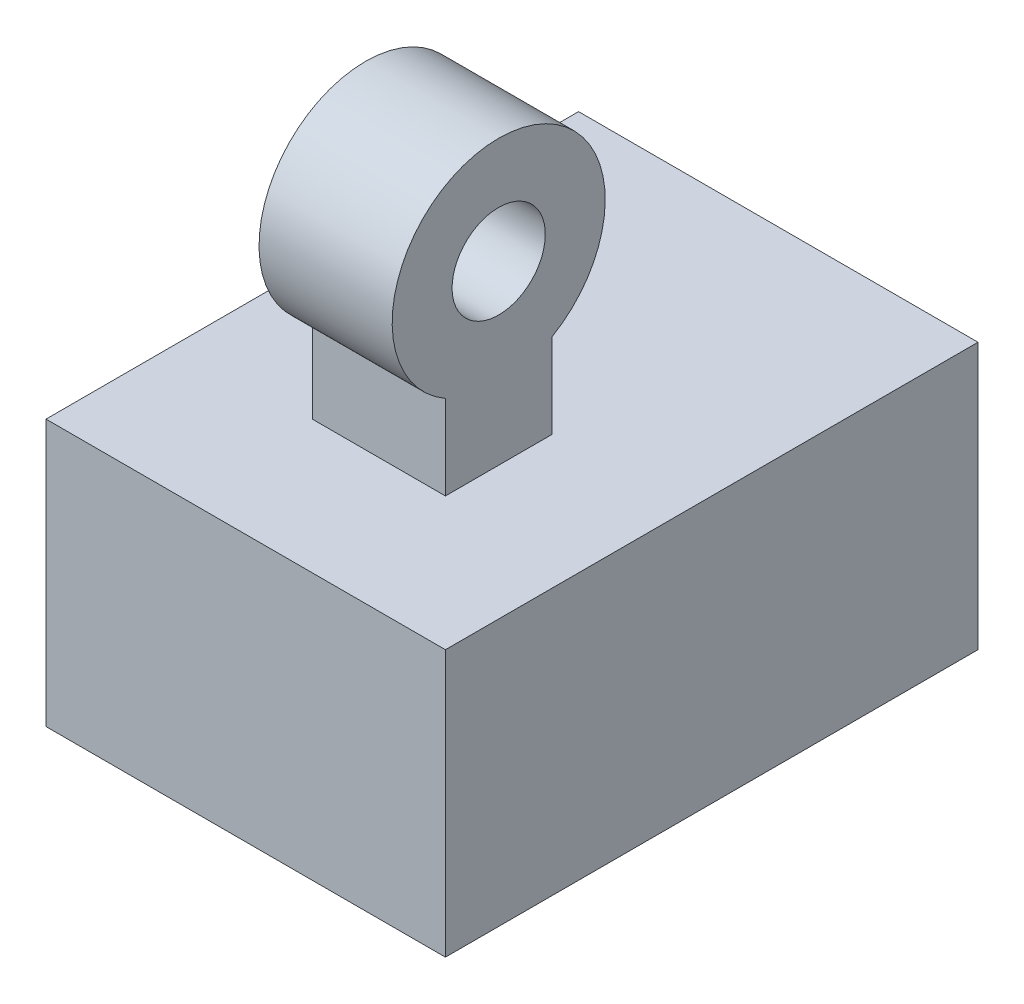
ISO-10303-21;
HEADER;
FILE_DESCRIPTION(('STEP AP214'),'2;1');
FILE_NAME('part.step','',(''),(''),'','','');
FILE_SCHEMA(('AUTOMOTIVE_DESIGN { 1 0 10303 214 1 1 1 1 }'));
ENDSEC;
DATA;
#1=APPLICATION_CONTEXT('core data for automotive mechanical design processes');
#2=APPLICATION_PROTOCOL_DEFINITION('international standard','automotive_design',2000,#1);
#3=PRODUCT_CONTEXT('',#1,'mechanical');
#4=PRODUCT('Part','Part','',(#3));
#5=PRODUCT_RELATED_PRODUCT_CATEGORY('part','',(#4));
#6=PRODUCT_DEFINITION_FORMATION('','',#4);
#7=PRODUCT_DEFINITION_CONTEXT('part definition',#1,'design');
#8=PRODUCT_DEFINITION('design','',#6,#7);
#9=PRODUCT_DEFINITION_SHAPE('','',#8);
#10=(LENGTH_UNIT() NAMED_UNIT(*) SI_UNIT(.MILLI.,.METRE.));
#11=(NAMED_UNIT(*) PLANE_ANGLE_UNIT() SI_UNIT($,.RADIAN.));
#12=(NAMED_UNIT(*) SI_UNIT($,.STERADIAN.) SOLID_ANGLE_UNIT());
#13=UNCERTAINTY_MEASURE_WITH_UNIT(LENGTH_MEASURE(1.E-05),#10,'distance_accuracy_value','');
#14=(GEOMETRIC_REPRESENTATION_CONTEXT(3) GLOBAL_UNCERTAINTY_ASSIGNED_CONTEXT((#13)) GLOBAL_UNIT_ASSIGNED_CONTEXT((#10,
#11,#12)) REPRESENTATION_CONTEXT('',''));
#15=CARTESIAN_POINT('',(0.,0.,0.));
#16=DIRECTION('',(0.,0.,1.));
#17=DIRECTION('',(1.,0.,0.));
#18=AXIS2_PLACEMENT_3D('',#15,#16,#17);
#19=CARTESIAN_POINT('',(-71.9564374402108,20.6734547930023,40.));
#20=DIRECTION('',(0.,-1.,0.));
#21=DIRECTION('',(1.,0.,0.));
#22=AXIS2_PLACEMENT_3D('',#19,#20,#21);
#23=PLANE('',#22);
#24=DIRECTION('',(-1.,0.,0.));
#25=VECTOR('',#24,1.);
#26=CARTESIAN_POINT('',(-71.9564374402108,20.6734547930023,0.));
#27=LINE('',#26,#25);
#28=CARTESIAN_POINT('',(-41.9564374402108,20.6734547930023,0.));
#29=VERTEX_POINT('',#28);
#30=CARTESIAN_POINT('',(-71.9564374402108,20.6734547930023,0.));
#31=VERTEX_POINT('',#30);
#32=EDGE_CURVE('E131',#29,#31,#27,.T.);
#33=ORIENTED_EDGE('',*,*,#32,.T.);
#34=DIRECTION('',(0.,0.,-1.));
#35=VECTOR('',#34,1.);
#36=CARTESIAN_POINT('',(-71.9564374402108,20.6734547930023,40.));
#37=LINE('',#36,#35);
#38=CARTESIAN_POINT('',(-71.9564374402108,20.6734547930023,40.));
#39=VERTEX_POINT('',#38);
#40=EDGE_CURVE('E137',#39,#31,#37,.T.);
#41=ORIENTED_EDGE('',*,*,#40,.F.);
#42=DIRECTION('',(-1.,0.,0.));
#43=VECTOR('',#42,1.);
#44=CARTESIAN_POINT('',(-71.9564374402108,20.6734547930023,40.));
#45=LINE('',#44,#43);
#46=CARTESIAN_POINT('',(-41.9564374402108,20.6734547930023,40.));
#47=VERTEX_POINT('',#46);
#48=EDGE_CURVE('E135',#47,#39,#45,.T.);
#49=ORIENTED_EDGE('',*,*,#48,.F.);
#50=DIRECTION('',(0.,0.,-1.));
#51=VECTOR('',#50,1.);
#52=CARTESIAN_POINT('',(-41.9564374402108,20.6734547930023,40.));
#53=LINE('',#52,#51);
#54=EDGE_CURVE('E147',#47,#29,#53,.T.);
#55=ORIENTED_EDGE('',*,*,#54,.T.);
#56=EDGE_LOOP('',(#33,#41,#49,#55));
#57=FACE_BOUND('',#56,.T.);
#58=DIRECTION('',(0.,0.,1.));
#59=VECTOR('',#58,1.);
#60=CARTESIAN_POINT('',(-61.9564374402108,20.6734547930023,30.));
#61=LINE('',#60,#59);
#62=CARTESIAN_POINT('',(-61.9564374402108,20.6734547930023,22.));
#63=VERTEX_POINT('',#62);
#64=CARTESIAN_POINT('',(-61.9564374402108,20.6734547930023,30.));
#65=VERTEX_POINT('',#64);
#66=EDGE_CURVE('E99',#63,#65,#61,.T.);
#67=ORIENTED_EDGE('',*,*,#66,.F.);
#68=DIRECTION('',(-1.,0.,0.));
#69=VECTOR('',#68,1.);
#70=CARTESIAN_POINT('',(-61.9564374402108,20.6734547930023,22.));
#71=LINE('',#70,#69);
#72=CARTESIAN_POINT('',(-51.9564374402108,20.6734547930023,22.));
#73=VERTEX_POINT('',#72);
#74=EDGE_CURVE('E106',#73,#63,#71,.T.);
#75=ORIENTED_EDGE('',*,*,#74,.F.);
#76=DIRECTION('',(0.,0.,-1.));
#77=VECTOR('',#76,1.);
#78=CARTESIAN_POINT('',(-51.9564374402108,20.6734547930023,30.));
#79=LINE('',#78,#77);
#80=CARTESIAN_POINT('',(-51.9564374402108,20.6734547930023,30.));
#81=VERTEX_POINT('',#80);
#82=EDGE_CURVE('E117',#81,#73,#79,.T.);
#83=ORIENTED_EDGE('',*,*,#82,.F.);
#84=DIRECTION('',(1.,0.,0.));
#85=VECTOR('',#84,1.);
#86=CARTESIAN_POINT('',(-61.9564374402108,20.6734547930023,30.));
#87=LINE('',#86,#85);
#88=EDGE_CURVE('E113',#65,#81,#87,.T.);
#89=ORIENTED_EDGE('',*,*,#88,.F.);
#90=EDGE_LOOP('',(#67,#75,#83,#89));
#91=FACE_BOUND('',#90,.T.);
#92=ADVANCED_FACE('F33',(#57,#91),#23,.F.);
#93=CARTESIAN_POINT('',(-71.9564374402108,20.6734547930023,40.));
#94=DIRECTION('',(1.,0.,0.));
#95=DIRECTION('',(0.,0.,-1.));
#96=AXIS2_PLACEMENT_3D('',#93,#94,#95);
#97=PLANE('',#96);
#98=DIRECTION('',(0.,-1.,0.));
#99=VECTOR('',#98,1.);
#100=CARTESIAN_POINT('',(-71.9564374402108,20.6734547930023,0.));
#101=LINE('',#100,#99);
#102=CARTESIAN_POINT('',(-71.9564374402108,0.673454793002293,0.));
#103=VERTEX_POINT('',#102);
#104=EDGE_CURVE('E126',#31,#103,#101,.T.);
#105=ORIENTED_EDGE('',*,*,#104,.T.);
#106=DIRECTION('',(0.,0.,-1.));
#107=VECTOR('',#106,1.);
#108=CARTESIAN_POINT('',(-71.9564374402108,0.673454793002293,40.));
#109=LINE('',#108,#107);
#110=CARTESIAN_POINT('',(-71.9564374402108,0.673454793002293,40.));
#111=VERTEX_POINT('',#110);
#112=EDGE_CURVE('E41',#111,#103,#109,.T.);
#113=ORIENTED_EDGE('',*,*,#112,.F.);
#114=DIRECTION('',(0.,-1.,0.));
#115=VECTOR('',#114,1.);
#116=CARTESIAN_POINT('',(-71.9564374402108,20.6734547930023,40.));
#117=LINE('',#116,#115);
#118=EDGE_CURVE('E127',#39,#111,#117,.T.);
#119=ORIENTED_EDGE('',*,*,#118,.F.);
#120=ORIENTED_EDGE('',*,*,#40,.T.);
#121=EDGE_LOOP('',(#105,#113,#119,#120));
#122=FACE_BOUND('',#121,.T.);
#123=ADVANCED_FACE('F35',(#122),#97,.F.);
#124=CARTESIAN_POINT('',(-71.9564374402108,0.673454793002293,40.));
#125=DIRECTION('',(0.,1.,0.));
#126=DIRECTION('',(0.,0.,1.));
#127=AXIS2_PLACEMENT_3D('',#124,#125,#126);
#128=PLANE('',#127);
#129=DIRECTION('',(1.,0.,0.));
#130=VECTOR('',#129,1.);
#131=CARTESIAN_POINT('',(-71.9564374402108,0.673454793002293,0.));
#132=LINE('',#131,#130);
#133=CARTESIAN_POINT('',(-41.9564374402108,0.673454793002293,0.));
#134=VERTEX_POINT('',#133);
#135=EDGE_CURVE('E140',#103,#134,#132,.T.);
#136=ORIENTED_EDGE('',*,*,#135,.T.);
#137=DIRECTION('',(0.,0.,-1.));
#138=VECTOR('',#137,1.);
#139=CARTESIAN_POINT('',(-41.9564374402108,0.673454793002293,40.));
#140=LINE('',#139,#138);
#141=CARTESIAN_POINT('',(-41.9564374402108,0.673454793002293,40.));
#142=VERTEX_POINT('',#141);
#143=EDGE_CURVE('E150',#142,#134,#140,.T.);
#144=ORIENTED_EDGE('',*,*,#143,.F.);
#145=DIRECTION('',(1.,0.,0.));
#146=VECTOR('',#145,1.);
#147=CARTESIAN_POINT('',(-71.9564374402108,0.673454793002293,40.));
#148=LINE('',#147,#146);
#149=EDGE_CURVE('E130',#111,#142,#148,.T.);
#150=ORIENTED_EDGE('',*,*,#149,.F.);
#151=ORIENTED_EDGE('',*,*,#112,.T.);
#152=EDGE_LOOP('',(#136,#144,#150,#151));
#153=FACE_BOUND('',#152,.T.);
#154=ADVANCED_FACE('F155',(#153),#128,.F.);
#155=CARTESIAN_POINT('',(-41.9564374402108,20.6734547930023,40.));
#156=DIRECTION('',(-1.,0.,0.));
#157=DIRECTION('',(0.,0.,1.));
#158=AXIS2_PLACEMENT_3D('',#155,#156,#157);
#159=PLANE('',#158);
#160=DIRECTION('',(0.,1.,0.));
#161=VECTOR('',#160,1.);
#162=CARTESIAN_POINT('',(-41.9564374402108,20.6734547930023,0.));
#163=LINE('',#162,#161);
#164=EDGE_CURVE('E142',#134,#29,#163,.T.);
#165=ORIENTED_EDGE('',*,*,#164,.T.);
#166=ORIENTED_EDGE('',*,*,#54,.F.);
#167=DIRECTION('',(0.,1.,0.));
#168=VECTOR('',#167,1.);
#169=CARTESIAN_POINT('',(-41.9564374402108,20.6734547930023,40.));
#170=LINE('',#169,#168);
#171=EDGE_CURVE('E133',#142,#47,#170,.T.);
#172=ORIENTED_EDGE('',*,*,#171,.F.);
#173=ORIENTED_EDGE('',*,*,#143,.T.);
#174=EDGE_LOOP('',(#165,#166,#172,#173));
#175=FACE_BOUND('',#174,.T.);
#176=ADVANCED_FACE('F167',(#175),#159,.F.);
#177=CARTESIAN_POINT('',(0.,0.,40.));
#178=DIRECTION('',(0.,0.,1.));
#179=DIRECTION('',(1.,0.,0.));
#180=AXIS2_PLACEMENT_3D('',#177,#178,#179);
#181=PLANE('',#180);
#182=ORIENTED_EDGE('',*,*,#118,.T.);
#183=ORIENTED_EDGE('',*,*,#149,.T.);
#184=ORIENTED_EDGE('',*,*,#171,.T.);
#185=ORIENTED_EDGE('',*,*,#48,.T.);
#186=EDGE_LOOP('',(#182,#183,#184,#185));
#187=FACE_BOUND('',#186,.T.);
#188=ADVANCED_FACE('F172',(#187),#181,.T.);
#189=CARTESIAN_POINT('',(0.,0.,0.));
#190=DIRECTION('',(0.,0.,1.));
#191=DIRECTION('',(1.,0.,0.));
#192=AXIS2_PLACEMENT_3D('',#189,#190,#191);
#193=PLANE('',#192);
#194=ORIENTED_EDGE('',*,*,#104,.F.);
#195=ORIENTED_EDGE('',*,*,#32,.F.);
#196=ORIENTED_EDGE('',*,*,#164,.F.);
#197=ORIENTED_EDGE('',*,*,#135,.F.);
#198=EDGE_LOOP('',(#194,#195,#196,#197));
#199=FACE_BOUND('',#198,.T.);
#200=ADVANCED_FACE('F163',(#199),#193,.F.);
#201=CARTESIAN_POINT('',(-61.9564374402108,28.6734547930023,30.));
#202=DIRECTION('',(1.,0.,0.));
#203=DIRECTION('',(0.,0.,-1.));
#204=AXIS2_PLACEMENT_3D('',#201,#202,#203);
#205=PLANE('',#204);
#206=DIRECTION('',(0.,-1.,0.));
#207=VECTOR('',#206,1.);
#208=CARTESIAN_POINT('',(-61.9564374402108,28.6734547930023,30.));
#209=LINE('',#208,#207);
#210=CARTESIAN_POINT('',(-61.9564374402108,27.0163771285262,30.));
#211=VERTEX_POINT('',#210);
#212=EDGE_CURVE('E124',#211,#65,#209,.T.);
#213=ORIENTED_EDGE('',*,*,#212,.F.);
#214=CARTESIAN_POINT('',(-61.9564374402108,33.9445803588017,26.));
#215=DIRECTION('',(1.,0.,0.));
#216=DIRECTION('',(0.,1.,0.));
#217=AXIS2_PLACEMENT_3D('',#214,#215,#216);
#218=CIRCLE('',#217,8.);
#219=CARTESIAN_POINT('',(-61.9564374402108,27.0163771285262,22.));
#220=VERTEX_POINT('',#219);
#221=EDGE_CURVE('E101',#220,#211,#218,.T.);
#222=ORIENTED_EDGE('',*,*,#221,.F.);
#223=DIRECTION('',(0.,-1.,0.));
#224=VECTOR('',#223,1.);
#225=CARTESIAN_POINT('',(-61.9564374402108,28.6734547930023,22.));
#226=LINE('',#225,#224);
#227=EDGE_CURVE('E95',#220,#63,#226,.T.);
#228=ORIENTED_EDGE('',*,*,#227,.T.);
#229=ORIENTED_EDGE('',*,*,#66,.T.);
#230=EDGE_LOOP('',(#213,#222,#228,#229));
#231=FACE_BOUND('',#230,.T.);
#232=CARTESIAN_POINT('',(-61.9564374402108,33.9445803588017,26.));
#233=DIRECTION('',(1.,0.,0.));
#234=DIRECTION('',(0.,1.,0.));
#235=AXIS2_PLACEMENT_3D('',#232,#233,#234);
#236=CIRCLE('',#235,3.5);
#237=CARTESIAN_POINT('',(-61.9564374402108,37.4445803588017,26.));
#238=VERTEX_POINT('',#237);
#239=EDGE_CURVE('E273',#238,#238,#236,.T.);
#240=ORIENTED_EDGE('',*,*,#239,.T.);
#241=EDGE_LOOP('',(#240));
#242=FACE_BOUND('',#241,.T.);
#243=ADVANCED_FACE('F97',(#231,#242),#205,.F.);
#244=CARTESIAN_POINT('',(-61.9564374402108,28.6734547930023,30.));
#245=DIRECTION('',(0.,0.,-1.));
#246=DIRECTION('',(-1.,0.,0.));
#247=AXIS2_PLACEMENT_3D('',#244,#245,#246);
#248=PLANE('',#247);
#249=DIRECTION('',(0.,-1.,0.));
#250=VECTOR('',#249,1.);
#251=CARTESIAN_POINT('',(-51.9564374402108,28.6734547930023,30.));
#252=LINE('',#251,#250);
#253=CARTESIAN_POINT('',(-51.9564374402108,27.0163771285262,30.));
#254=VERTEX_POINT('',#253);
#255=EDGE_CURVE('E53',#254,#81,#252,.T.);
#256=ORIENTED_EDGE('',*,*,#255,.F.);
#257=DIRECTION('',(1.,0.,0.));
#258=VECTOR('',#257,1.);
#259=CARTESIAN_POINT('',(-61.9564374402108,27.0163771285262,30.));
#260=LINE('',#259,#258);
#261=EDGE_CURVE('E48',#254,#211,#260,.F.);
#262=ORIENTED_EDGE('',*,*,#261,.T.);
#263=ORIENTED_EDGE('',*,*,#212,.T.);
#264=ORIENTED_EDGE('',*,*,#88,.T.);
#265=EDGE_LOOP('',(#256,#262,#263,#264));
#266=FACE_BOUND('',#265,.T.);
#267=ADVANCED_FACE('F220',(#266),#248,.F.);
#268=CARTESIAN_POINT('',(-51.9564374402108,28.6734547930023,30.));
#269=DIRECTION('',(-1.,0.,0.));
#270=DIRECTION('',(0.,-1.,0.));
#271=AXIS2_PLACEMENT_3D('',#268,#269,#270);
#272=PLANE('',#271);
#273=CARTESIAN_POINT('',(-51.9564374402108,33.9445803588017,26.));
#274=DIRECTION('',(1.,0.,0.));
#275=DIRECTION('',(0.,1.,0.));
#276=AXIS2_PLACEMENT_3D('',#273,#274,#275);
#277=CIRCLE('',#276,8.);
#278=CARTESIAN_POINT('',(-51.9564374402108,27.0163771285262,22.));
#279=VERTEX_POINT('',#278);
#280=EDGE_CURVE('E279',#279,#254,#277,.T.);
#281=ORIENTED_EDGE('',*,*,#280,.T.);
#282=ORIENTED_EDGE('',*,*,#255,.T.);
#283=ORIENTED_EDGE('',*,*,#82,.T.);
#284=DIRECTION('',(0.,-1.,0.));
#285=VECTOR('',#284,1.);
#286=CARTESIAN_POINT('',(-51.9564374402108,28.6734547930023,22.));
#287=LINE('',#286,#285);
#288=EDGE_CURVE('E105',#279,#73,#287,.T.);
#289=ORIENTED_EDGE('',*,*,#288,.F.);
#290=EDGE_LOOP('',(#281,#282,#283,#289));
#291=FACE_BOUND('',#290,.T.);
#292=CARTESIAN_POINT('',(-51.9564374402108,33.9445803588017,26.));
#293=DIRECTION('',(1.,0.,0.));
#294=DIRECTION('',(0.,1.,0.));
#295=AXIS2_PLACEMENT_3D('',#292,#293,#294);
#296=CIRCLE('',#295,3.5);
#297=CARTESIAN_POINT('',(-51.9564374402108,37.4445803588017,26.));
#298=VERTEX_POINT('',#297);
#299=EDGE_CURVE('E276',#298,#298,#296,.T.);
#300=ORIENTED_EDGE('',*,*,#299,.F.);
#301=EDGE_LOOP('',(#300));
#302=FACE_BOUND('',#301,.T.);
#303=ADVANCED_FACE('F230',(#291,#302),#272,.F.);
#304=CARTESIAN_POINT('',(-61.9564374402108,28.6734547930023,22.));
#305=DIRECTION('',(0.,0.,1.));
#306=DIRECTION('',(1.,0.,0.));
#307=AXIS2_PLACEMENT_3D('',#304,#305,#306);
#308=PLANE('',#307);
#309=ORIENTED_EDGE('',*,*,#227,.F.);
#310=DIRECTION('',(1.,0.,0.));
#311=VECTOR('',#310,1.);
#312=CARTESIAN_POINT('',(-61.9564374402108,27.0163771285262,22.));
#313=LINE('',#312,#311);
#314=EDGE_CURVE('E11',#220,#279,#313,.T.);
#315=ORIENTED_EDGE('',*,*,#314,.T.);
#316=ORIENTED_EDGE('',*,*,#288,.T.);
#317=ORIENTED_EDGE('',*,*,#74,.T.);
#318=EDGE_LOOP('',(#309,#315,#316,#317));
#319=FACE_BOUND('',#318,.T.);
#320=ADVANCED_FACE('F115',(#319),#308,.F.);
#321=CARTESIAN_POINT('',(-61.9564374402108,33.9445803588017,26.));
#322=DIRECTION('',(1.,0.,0.));
#323=DIRECTION('',(0.,1.,0.));
#324=AXIS2_PLACEMENT_3D('',#321,#322,#323);
#325=CYLINDRICAL_SURFACE('',#324,8.);
#326=ORIENTED_EDGE('',*,*,#261,.F.);
#327=ORIENTED_EDGE('',*,*,#280,.F.);
#328=ORIENTED_EDGE('',*,*,#314,.F.);
#329=ORIENTED_EDGE('',*,*,#221,.T.);
#330=EDGE_LOOP('',(#326,#327,#328,#329));
#331=FACE_BOUND('',#330,.T.);
#332=ADVANCED_FACE('F248',(#331),#325,.T.);
#333=CARTESIAN_POINT('',(-61.9564374402108,33.9445803588017,26.));
#334=DIRECTION('',(1.,0.,0.));
#335=DIRECTION('',(0.,1.,0.));
#336=AXIS2_PLACEMENT_3D('',#333,#334,#335);
#337=CYLINDRICAL_SURFACE('',#336,3.5);
#338=ORIENTED_EDGE('',*,*,#239,.F.);
#339=EDGE_LOOP('',(#338));
#340=FACE_BOUND('',#339,.T.);
#341=ORIENTED_EDGE('',*,*,#299,.T.);
#342=EDGE_LOOP('',(#341));
#343=FACE_BOUND('',#342,.T.);
#344=ADVANCED_FACE('F256',(#340,#343),#337,.F.);
#345=CLOSED_SHELL('',(#92,#123,#154,#176,#188,#200,#243,#267,#303,#320,#332,#344));
#346=MANIFOLD_SOLID_BREP('B2',#345);
#347=ADVANCED_BREP_SHAPE_REPRESENTATION('',(#18,#346),#14);
#348=SHAPE_DEFINITION_REPRESENTATION(#9,#347);
ENDSEC;
END-ISO-10303-21;
